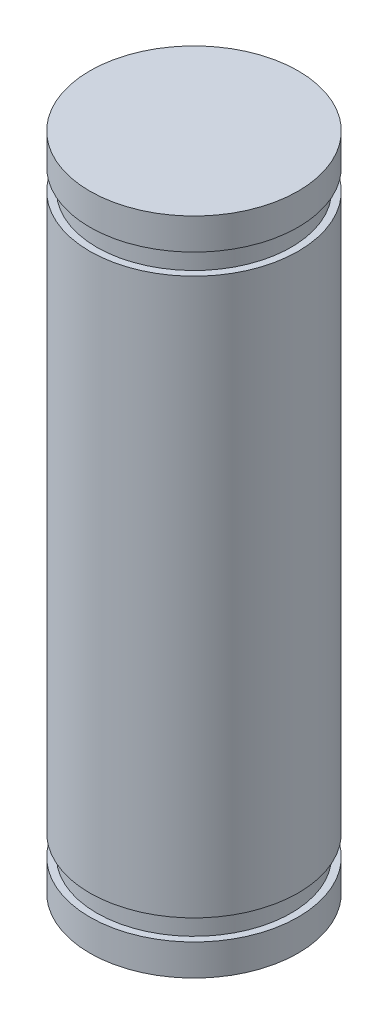
ISO-10303-21;
HEADER;
FILE_DESCRIPTION(('STEP AP214'),'2;1');
FILE_NAME('part.step','',(''),(''),'','','');
FILE_SCHEMA(('AUTOMOTIVE_DESIGN { 1 0 10303 214 1 1 1 1 }'));
ENDSEC;
DATA;
#1=APPLICATION_CONTEXT('core data for automotive mechanical design processes');
#2=APPLICATION_PROTOCOL_DEFINITION('international standard','automotive_design',2000,#1);
#3=PRODUCT_CONTEXT('',#1,'mechanical');
#4=PRODUCT('Part','Part','',(#3));
#5=PRODUCT_RELATED_PRODUCT_CATEGORY('part','',(#4));
#6=PRODUCT_DEFINITION_FORMATION('','',#4);
#7=PRODUCT_DEFINITION_CONTEXT('part definition',#1,'design');
#8=PRODUCT_DEFINITION('design','',#6,#7);
#9=PRODUCT_DEFINITION_SHAPE('','',#8);
#10=(LENGTH_UNIT() NAMED_UNIT(*) SI_UNIT(.MILLI.,.METRE.));
#11=(NAMED_UNIT(*) PLANE_ANGLE_UNIT() SI_UNIT($,.RADIAN.));
#12=(NAMED_UNIT(*) SI_UNIT($,.STERADIAN.) SOLID_ANGLE_UNIT());
#13=UNCERTAINTY_MEASURE_WITH_UNIT(LENGTH_MEASURE(1.E-05),#10,'distance_accuracy_value','');
#14=(GEOMETRIC_REPRESENTATION_CONTEXT(3) GLOBAL_UNCERTAINTY_ASSIGNED_CONTEXT((#13)) GLOBAL_UNIT_ASSIGNED_CONTEXT((#10,
#11,#12)) REPRESENTATION_CONTEXT('',''));
#15=CARTESIAN_POINT('',(0.,0.,0.));
#16=DIRECTION('',(0.,0.,1.));
#17=DIRECTION('',(1.,0.,0.));
#18=AXIS2_PLACEMENT_3D('',#15,#16,#17);
#19=CARTESIAN_POINT('',(0.,9.5,0.));
#20=DIRECTION('',(0.,1.,0.));
#21=DIRECTION('',(0.,0.,1.));
#22=AXIS2_PLACEMENT_3D('',#19,#20,#21);
#23=CYLINDRICAL_SURFACE('',#22,3.);
#24=CARTESIAN_POINT('',(0.,-8.6,0.));
#25=DIRECTION('',(0.,1.,0.));
#26=DIRECTION('',(0.,0.,1.));
#27=AXIS2_PLACEMENT_3D('',#24,#25,#26);
#28=CIRCLE('',#27,3.);
#29=CARTESIAN_POINT('',(0.,-8.6,3.));
#30=VERTEX_POINT('',#29);
#31=EDGE_CURVE('E10',#30,#30,#28,.T.);
#32=ORIENTED_EDGE('',*,*,#31,.F.);
#33=EDGE_LOOP('',(#32));
#34=FACE_BOUND('',#33,.T.);
#35=CARTESIAN_POINT('',(0.,-9.5,0.));
#36=DIRECTION('',(0.,1.,0.));
#37=DIRECTION('',(0.,0.,1.));
#38=AXIS2_PLACEMENT_3D('',#35,#36,#37);
#39=CIRCLE('',#38,3.);
#40=CARTESIAN_POINT('',(0.,-9.5,3.));
#41=VERTEX_POINT('',#40);
#42=EDGE_CURVE('E80',#41,#41,#39,.T.);
#43=ORIENTED_EDGE('',*,*,#42,.T.);
#44=EDGE_LOOP('',(#43));
#45=FACE_BOUND('',#44,.T.);
#46=ADVANCED_FACE('F34',(#34,#45),#23,.T.);
#47=CARTESIAN_POINT('',(3.,-8.6,0.));
#48=DIRECTION('',(0.,-1.,0.));
#49=DIRECTION('',(0.,0.,-1.));
#50=AXIS2_PLACEMENT_3D('',#47,#48,#49);
#51=PLANE('',#50);
#52=CARTESIAN_POINT('',(0.,-8.6,0.));
#53=DIRECTION('',(0.,1.,0.));
#54=DIRECTION('',(0.,0.,1.));
#55=AXIS2_PLACEMENT_3D('',#52,#53,#54);
#56=CIRCLE('',#55,2.8);
#57=CARTESIAN_POINT('',(0.,-8.6,2.8));
#58=VERTEX_POINT('',#57);
#59=EDGE_CURVE('E41',#58,#58,#56,.T.);
#60=ORIENTED_EDGE('',*,*,#59,.F.);
#61=EDGE_LOOP('',(#60));
#62=FACE_BOUND('',#61,.T.);
#63=ORIENTED_EDGE('',*,*,#31,.T.);
#64=EDGE_LOOP('',(#63));
#65=FACE_BOUND('',#64,.T.);
#66=ADVANCED_FACE('F97',(#62,#65),#51,.F.);
#67=CARTESIAN_POINT('',(0.,9.5,0.));
#68=DIRECTION('',(0.,1.,0.));
#69=DIRECTION('',(0.,0.,1.));
#70=AXIS2_PLACEMENT_3D('',#67,#68,#69);
#71=CYLINDRICAL_SURFACE('',#70,2.8);
#72=CARTESIAN_POINT('',(0.,-8.,0.));
#73=DIRECTION('',(0.,1.,0.));
#74=DIRECTION('',(0.,0.,1.));
#75=AXIS2_PLACEMENT_3D('',#72,#73,#74);
#76=CIRCLE('',#75,2.8);
#77=CARTESIAN_POINT('',(0.,-8.,2.8));
#78=VERTEX_POINT('',#77);
#79=EDGE_CURVE('E48',#78,#78,#76,.T.);
#80=ORIENTED_EDGE('',*,*,#79,.F.);
#81=EDGE_LOOP('',(#80));
#82=FACE_BOUND('',#81,.T.);
#83=ORIENTED_EDGE('',*,*,#59,.T.);
#84=EDGE_LOOP('',(#83));
#85=FACE_BOUND('',#84,.T.);
#86=ADVANCED_FACE('F102',(#82,#85),#71,.T.);
#87=CARTESIAN_POINT('',(2.8,-8.,0.));
#88=DIRECTION('',(0.,1.,0.));
#89=DIRECTION('',(0.,0.,1.));
#90=AXIS2_PLACEMENT_3D('',#87,#88,#89);
#91=PLANE('',#90);
#92=CARTESIAN_POINT('',(0.,-8.,0.));
#93=DIRECTION('',(0.,1.,0.));
#94=DIRECTION('',(0.,0.,1.));
#95=AXIS2_PLACEMENT_3D('',#92,#93,#94);
#96=CIRCLE('',#95,3.);
#97=CARTESIAN_POINT('',(0.,-8.,3.));
#98=VERTEX_POINT('',#97);
#99=EDGE_CURVE('E55',#98,#98,#96,.T.);
#100=ORIENTED_EDGE('',*,*,#99,.F.);
#101=EDGE_LOOP('',(#100));
#102=FACE_BOUND('',#101,.T.);
#103=ORIENTED_EDGE('',*,*,#79,.T.);
#104=EDGE_LOOP('',(#103));
#105=FACE_BOUND('',#104,.T.);
#106=ADVANCED_FACE('F107',(#102,#105),#91,.F.);
#107=CARTESIAN_POINT('',(0.,9.5,0.));
#108=DIRECTION('',(0.,1.,0.));
#109=DIRECTION('',(0.,0.,1.));
#110=AXIS2_PLACEMENT_3D('',#107,#108,#109);
#111=CYLINDRICAL_SURFACE('',#110,3.);
#112=CARTESIAN_POINT('',(0.,8.,0.));
#113=DIRECTION('',(0.,1.,0.));
#114=DIRECTION('',(0.,0.,1.));
#115=AXIS2_PLACEMENT_3D('',#112,#113,#114);
#116=CIRCLE('',#115,3.);
#117=CARTESIAN_POINT('',(0.,8.,3.));
#118=VERTEX_POINT('',#117);
#119=EDGE_CURVE('E61',#118,#118,#116,.T.);
#120=ORIENTED_EDGE('',*,*,#119,.F.);
#121=EDGE_LOOP('',(#120));
#122=FACE_BOUND('',#121,.T.);
#123=ORIENTED_EDGE('',*,*,#99,.T.);
#124=EDGE_LOOP('',(#123));
#125=FACE_BOUND('',#124,.T.);
#126=ADVANCED_FACE('F113',(#122,#125),#111,.T.);
#127=CARTESIAN_POINT('',(3.,8.,0.));
#128=DIRECTION('',(0.,-1.,0.));
#129=DIRECTION('',(0.,0.,-1.));
#130=AXIS2_PLACEMENT_3D('',#127,#128,#129);
#131=PLANE('',#130);
#132=CARTESIAN_POINT('',(0.,8.,0.));
#133=DIRECTION('',(0.,1.,0.));
#134=DIRECTION('',(0.,0.,1.));
#135=AXIS2_PLACEMENT_3D('',#132,#133,#134);
#136=CIRCLE('',#135,2.8);
#137=CARTESIAN_POINT('',(0.,8.,2.8));
#138=VERTEX_POINT('',#137);
#139=EDGE_CURVE('E65',#138,#138,#136,.T.);
#140=ORIENTED_EDGE('',*,*,#139,.F.);
#141=EDGE_LOOP('',(#140));
#142=FACE_BOUND('',#141,.T.);
#143=ORIENTED_EDGE('',*,*,#119,.T.);
#144=EDGE_LOOP('',(#143));
#145=FACE_BOUND('',#144,.T.);
#146=ADVANCED_FACE('F117',(#142,#145),#131,.F.);
#147=CARTESIAN_POINT('',(0.,9.5,0.));
#148=DIRECTION('',(0.,1.,0.));
#149=DIRECTION('',(0.,0.,1.));
#150=AXIS2_PLACEMENT_3D('',#147,#148,#149);
#151=CYLINDRICAL_SURFACE('',#150,2.8);
#152=CARTESIAN_POINT('',(0.,8.6,0.));
#153=DIRECTION('',(0.,1.,0.));
#154=DIRECTION('',(0.,0.,1.));
#155=AXIS2_PLACEMENT_3D('',#152,#153,#154);
#156=CIRCLE('',#155,2.8);
#157=CARTESIAN_POINT('',(0.,8.6,2.8));
#158=VERTEX_POINT('',#157);
#159=EDGE_CURVE('E68',#158,#158,#156,.T.);
#160=ORIENTED_EDGE('',*,*,#159,.F.);
#161=EDGE_LOOP('',(#160));
#162=FACE_BOUND('',#161,.T.);
#163=ORIENTED_EDGE('',*,*,#139,.T.);
#164=EDGE_LOOP('',(#163));
#165=FACE_BOUND('',#164,.T.);
#166=ADVANCED_FACE('F121',(#162,#165),#151,.T.);
#167=CARTESIAN_POINT('',(2.8,8.6,0.));
#168=DIRECTION('',(0.,1.,0.));
#169=DIRECTION('',(0.,0.,1.));
#170=AXIS2_PLACEMENT_3D('',#167,#168,#169);
#171=PLANE('',#170);
#172=CARTESIAN_POINT('',(0.,8.6,0.));
#173=DIRECTION('',(0.,1.,0.));
#174=DIRECTION('',(0.,0.,1.));
#175=AXIS2_PLACEMENT_3D('',#172,#173,#174);
#176=CIRCLE('',#175,3.);
#177=CARTESIAN_POINT('',(0.,8.6,3.));
#178=VERTEX_POINT('',#177);
#179=EDGE_CURVE('E72',#178,#178,#176,.T.);
#180=ORIENTED_EDGE('',*,*,#179,.F.);
#181=EDGE_LOOP('',(#180));
#182=FACE_BOUND('',#181,.T.);
#183=ORIENTED_EDGE('',*,*,#159,.T.);
#184=EDGE_LOOP('',(#183));
#185=FACE_BOUND('',#184,.T.);
#186=ADVANCED_FACE('F125',(#182,#185),#171,.F.);
#187=CARTESIAN_POINT('',(0.,9.5,0.));
#188=DIRECTION('',(0.,1.,0.));
#189=DIRECTION('',(0.,0.,1.));
#190=AXIS2_PLACEMENT_3D('',#187,#188,#189);
#191=CYLINDRICAL_SURFACE('',#190,3.);
#192=CARTESIAN_POINT('',(0.,9.5,0.));
#193=DIRECTION('',(0.,1.,0.));
#194=DIRECTION('',(0.,0.,1.));
#195=AXIS2_PLACEMENT_3D('',#192,#193,#194);
#196=CIRCLE('',#195,3.);
#197=CARTESIAN_POINT('',(0.,9.5,3.));
#198=VERTEX_POINT('',#197);
#199=EDGE_CURVE('E76',#198,#198,#196,.T.);
#200=ORIENTED_EDGE('',*,*,#199,.F.);
#201=EDGE_LOOP('',(#200));
#202=FACE_BOUND('',#201,.T.);
#203=ORIENTED_EDGE('',*,*,#179,.T.);
#204=EDGE_LOOP('',(#203));
#205=FACE_BOUND('',#204,.T.);
#206=ADVANCED_FACE('F93',(#202,#205),#191,.T.);
#207=CARTESIAN_POINT('',(3.,9.5,0.));
#208=DIRECTION('',(0.,-1.,0.));
#209=DIRECTION('',(0.,0.,-1.));
#210=AXIS2_PLACEMENT_3D('',#207,#208,#209);
#211=PLANE('',#210);
#212=ORIENTED_EDGE('',*,*,#199,.T.);
#213=EDGE_LOOP('',(#212));
#214=FACE_BOUND('',#213,.T.);
#215=ADVANCED_FACE('F88',(#214),#211,.F.);
#216=CARTESIAN_POINT('',(0.,-9.5,0.));
#217=DIRECTION('',(0.,1.,0.));
#218=DIRECTION('',(0.,0.,1.));
#219=AXIS2_PLACEMENT_3D('',#216,#217,#218);
#220=PLANE('',#219);
#221=ORIENTED_EDGE('',*,*,#42,.F.);
#222=EDGE_LOOP('',(#221));
#223=FACE_BOUND('',#222,.T.);
#224=ADVANCED_FACE('F86',(#223),#220,.F.);
#225=CLOSED_SHELL('',(#46,#66,#86,#106,#126,#146,#166,#186,#206,#215,#224));
#226=MANIFOLD_SOLID_BREP('B2',#225);
#227=ADVANCED_BREP_SHAPE_REPRESENTATION('',(#18,#226),#14);
#228=SHAPE_DEFINITION_REPRESENTATION(#9,#227);
ENDSEC;
END-ISO-10303-21;
